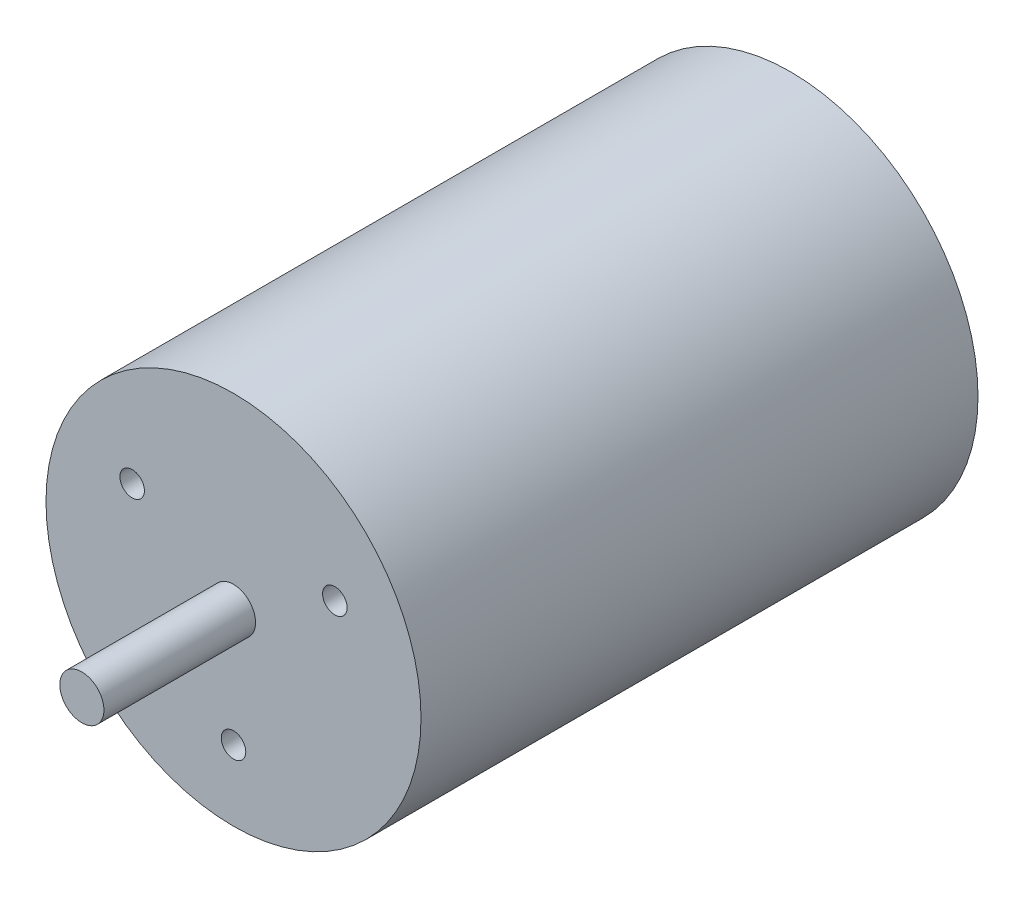
ISO-10303-21;
HEADER;
FILE_DESCRIPTION(('STEP AP214'),'2;1');
FILE_NAME('part.step','',(''),(''),'','','');
FILE_SCHEMA(('AUTOMOTIVE_DESIGN { 1 0 10303 214 1 1 1 1 }'));
ENDSEC;
DATA;
#1=APPLICATION_CONTEXT('core data for automotive mechanical design processes');
#2=APPLICATION_PROTOCOL_DEFINITION('international standard','automotive_design',2000,#1);
#3=PRODUCT_CONTEXT('',#1,'mechanical');
#4=PRODUCT('Part','Part','',(#3));
#5=PRODUCT_RELATED_PRODUCT_CATEGORY('part','',(#4));
#6=PRODUCT_DEFINITION_FORMATION('','',#4);
#7=PRODUCT_DEFINITION_CONTEXT('part definition',#1,'design');
#8=PRODUCT_DEFINITION('design','',#6,#7);
#9=PRODUCT_DEFINITION_SHAPE('','',#8);
#10=(LENGTH_UNIT() NAMED_UNIT(*) SI_UNIT(.MILLI.,.METRE.));
#11=(NAMED_UNIT(*) PLANE_ANGLE_UNIT() SI_UNIT($,.RADIAN.));
#12=(NAMED_UNIT(*) SI_UNIT($,.STERADIAN.) SOLID_ANGLE_UNIT());
#13=UNCERTAINTY_MEASURE_WITH_UNIT(LENGTH_MEASURE(1.E-05),#10,'distance_accuracy_value','');
#14=(GEOMETRIC_REPRESENTATION_CONTEXT(3) GLOBAL_UNCERTAINTY_ASSIGNED_CONTEXT((#13)) GLOBAL_UNIT_ASSIGNED_CONTEXT((#10,
#11,#12)) REPRESENTATION_CONTEXT('',''));
#15=CARTESIAN_POINT('',(0.,0.,0.));
#16=DIRECTION('',(0.,0.,1.));
#17=DIRECTION('',(1.,0.,0.));
#18=AXIS2_PLACEMENT_3D('',#15,#16,#17);
#19=CARTESIAN_POINT('',(0.,0.,101.));
#20=DIRECTION('',(0.,0.,-1.));
#21=DIRECTION('',(-1.,0.,0.));
#22=AXIS2_PLACEMENT_3D('',#19,#20,#21);
#23=CYLINDRICAL_SURFACE('',#22,34.);
#24=CARTESIAN_POINT('',(0.,0.,101.));
#25=DIRECTION('',(0.,0.,1.));
#26=DIRECTION('',(1.,0.,0.));
#27=AXIS2_PLACEMENT_3D('',#24,#25,#26);
#28=CIRCLE('',#27,34.);
#29=CARTESIAN_POINT('',(34.,0.,101.));
#30=VERTEX_POINT('',#29);
#31=EDGE_CURVE('E41',#30,#30,#28,.T.);
#32=ORIENTED_EDGE('',*,*,#31,.F.);
#33=EDGE_LOOP('',(#32));
#34=FACE_BOUND('',#33,.T.);
#35=CARTESIAN_POINT('',(0.,0.,0.));
#36=DIRECTION('',(0.,0.,1.));
#37=DIRECTION('',(1.,0.,0.));
#38=AXIS2_PLACEMENT_3D('',#35,#36,#37);
#39=CIRCLE('',#38,34.);
#40=CARTESIAN_POINT('',(34.,0.,0.));
#41=VERTEX_POINT('',#40);
#42=EDGE_CURVE('E37',#41,#41,#39,.T.);
#43=ORIENTED_EDGE('',*,*,#42,.T.);
#44=EDGE_LOOP('',(#43));
#45=FACE_BOUND('',#44,.T.);
#46=ADVANCED_FACE('F34',(#34,#45),#23,.T.);
#47=CARTESIAN_POINT('',(0.,0.,101.));
#48=DIRECTION('',(0.,0.,1.));
#49=DIRECTION('',(1.,0.,0.));
#50=AXIS2_PLACEMENT_3D('',#47,#48,#49);
#51=PLANE('',#50);
#52=CARTESIAN_POINT('',(-18.375,10.6088111963594,101.));
#53=DIRECTION('',(0.,0.,1.));
#54=DIRECTION('',(1.,0.,0.));
#55=AXIS2_PLACEMENT_3D('',#52,#53,#54);
#56=CIRCLE('',#55,2.225);
#57=CARTESIAN_POINT('',(-16.15,10.6088111963594,101.));
#58=VERTEX_POINT('',#57);
#59=EDGE_CURVE('E53',#58,#58,#56,.T.);
#60=ORIENTED_EDGE('',*,*,#59,.F.);
#61=EDGE_LOOP('',(#60));
#62=FACE_BOUND('',#61,.T.);
#63=CARTESIAN_POINT('',(18.375,10.6088111963594,101.));
#64=DIRECTION('',(0.,0.,1.));
#65=DIRECTION('',(1.,0.,0.));
#66=AXIS2_PLACEMENT_3D('',#63,#64,#65);
#67=CIRCLE('',#66,2.225);
#68=CARTESIAN_POINT('',(20.6,10.6088111963594,101.));
#69=VERTEX_POINT('',#68);
#70=EDGE_CURVE('E56',#69,#69,#67,.T.);
#71=ORIENTED_EDGE('',*,*,#70,.F.);
#72=EDGE_LOOP('',(#71));
#73=FACE_BOUND('',#72,.T.);
#74=CARTESIAN_POINT('',(0.,-21.2176223927188,101.));
#75=DIRECTION('',(0.,0.,1.));
#76=DIRECTION('',(1.,0.,0.));
#77=AXIS2_PLACEMENT_3D('',#74,#75,#76);
#78=CIRCLE('',#77,2.225);
#79=CARTESIAN_POINT('',(2.225,-21.2176223927188,101.));
#80=VERTEX_POINT('',#79);
#81=EDGE_CURVE('E62',#80,#80,#78,.T.);
#82=ORIENTED_EDGE('',*,*,#81,.F.);
#83=EDGE_LOOP('',(#82));
#84=FACE_BOUND('',#83,.T.);
#85=CARTESIAN_POINT('',(0.,0.,101.));
#86=DIRECTION('',(0.,0.,1.));
#87=DIRECTION('',(1.,0.,0.));
#88=AXIS2_PLACEMENT_3D('',#85,#86,#87);
#89=CIRCLE('',#88,4.);
#90=CARTESIAN_POINT('',(4.,0.,101.));
#91=VERTEX_POINT('',#90);
#92=EDGE_CURVE('E52',#91,#91,#89,.T.);
#93=ORIENTED_EDGE('',*,*,#92,.F.);
#94=EDGE_LOOP('',(#93));
#95=FACE_BOUND('',#94,.T.);
#96=ORIENTED_EDGE('',*,*,#31,.T.);
#97=EDGE_LOOP('',(#96));
#98=FACE_BOUND('',#97,.T.);
#99=ADVANCED_FACE('F76',(#62,#73,#84,#95,#98),#51,.T.);
#100=CARTESIAN_POINT('',(0.,0.,0.));
#101=DIRECTION('',(0.,0.,1.));
#102=DIRECTION('',(1.,0.,0.));
#103=AXIS2_PLACEMENT_3D('',#100,#101,#102);
#104=PLANE('',#103);
#105=CARTESIAN_POINT('',(0.,0.,0.));
#106=DIRECTION('',(0.,0.,-1.));
#107=DIRECTION('',(-1.,0.,0.));
#108=AXIS2_PLACEMENT_3D('',#105,#106,#107);
#109=CIRCLE('',#108,14.);
#110=CARTESIAN_POINT('',(-14.,0.,0.));
#111=VERTEX_POINT('',#110);
#112=EDGE_CURVE('E10',#111,#111,#109,.T.);
#113=ORIENTED_EDGE('',*,*,#112,.F.);
#114=EDGE_LOOP('',(#113));
#115=FACE_BOUND('',#114,.T.);
#116=ORIENTED_EDGE('',*,*,#42,.F.);
#117=EDGE_LOOP('',(#116));
#118=FACE_BOUND('',#117,.T.);
#119=ADVANCED_FACE('F79',(#115,#118),#104,.F.);
#120=CARTESIAN_POINT('',(0.,0.,128.5));
#121=DIRECTION('',(0.,0.,-1.));
#122=DIRECTION('',(-1.,0.,0.));
#123=AXIS2_PLACEMENT_3D('',#120,#121,#122);
#124=CYLINDRICAL_SURFACE('',#123,4.);
#125=CARTESIAN_POINT('',(0.,0.,128.5));
#126=DIRECTION('',(0.,0.,1.));
#127=DIRECTION('',(1.,0.,0.));
#128=AXIS2_PLACEMENT_3D('',#125,#126,#127);
#129=CIRCLE('',#128,4.);
#130=CARTESIAN_POINT('',(4.,0.,128.5));
#131=VERTEX_POINT('',#130);
#132=EDGE_CURVE('E68',#131,#131,#129,.T.);
#133=ORIENTED_EDGE('',*,*,#132,.F.);
#134=EDGE_LOOP('',(#133));
#135=FACE_BOUND('',#134,.T.);
#136=ORIENTED_EDGE('',*,*,#92,.T.);
#137=EDGE_LOOP('',(#136));
#138=FACE_BOUND('',#137,.T.);
#139=ADVANCED_FACE('F74',(#135,#138),#124,.T.);
#140=CARTESIAN_POINT('',(0.,0.,128.5));
#141=DIRECTION('',(0.,0.,1.));
#142=DIRECTION('',(1.,0.,0.));
#143=AXIS2_PLACEMENT_3D('',#140,#141,#142);
#144=PLANE('',#143);
#145=ORIENTED_EDGE('',*,*,#132,.T.);
#146=EDGE_LOOP('',(#145));
#147=FACE_BOUND('',#146,.T.);
#148=ADVANCED_FACE('F94',(#147),#144,.T.);
#149=CARTESIAN_POINT('',(0.,-21.2176223927188,81.));
#150=DIRECTION('',(0.,0.,1.));
#151=DIRECTION('',(1.,0.,0.));
#152=AXIS2_PLACEMENT_3D('',#149,#150,#151);
#153=CYLINDRICAL_SURFACE('',#152,2.225);
#154=CARTESIAN_POINT('',(0.,-21.2176223927188,81.));
#155=DIRECTION('',(0.,0.,1.));
#156=DIRECTION('',(1.,0.,0.));
#157=AXIS2_PLACEMENT_3D('',#154,#155,#156);
#158=CIRCLE('',#157,2.225);
#159=CARTESIAN_POINT('',(2.225,-21.2176223927188,81.));
#160=VERTEX_POINT('',#159);
#161=EDGE_CURVE('E65',#160,#160,#158,.T.);
#162=ORIENTED_EDGE('',*,*,#161,.F.);
#163=EDGE_LOOP('',(#162));
#164=FACE_BOUND('',#163,.T.);
#165=ORIENTED_EDGE('',*,*,#81,.T.);
#166=EDGE_LOOP('',(#165));
#167=FACE_BOUND('',#166,.T.);
#168=ADVANCED_FACE('F100',(#164,#167),#153,.F.);
#169=CARTESIAN_POINT('',(0.,-21.2176223927188,81.));
#170=DIRECTION('',(0.,0.,1.));
#171=DIRECTION('',(1.,0.,0.));
#172=AXIS2_PLACEMENT_3D('',#169,#170,#171);
#173=PLANE('',#172);
#174=ORIENTED_EDGE('',*,*,#161,.T.);
#175=EDGE_LOOP('',(#174));
#176=FACE_BOUND('',#175,.T.);
#177=ADVANCED_FACE('F102',(#176),#173,.T.);
#178=CARTESIAN_POINT('',(18.375,10.6088111963594,81.));
#179=DIRECTION('',(0.,0.,1.));
#180=DIRECTION('',(1.,0.,0.));
#181=AXIS2_PLACEMENT_3D('',#178,#179,#180);
#182=CYLINDRICAL_SURFACE('',#181,2.225);
#183=CARTESIAN_POINT('',(18.375,10.6088111963594,81.));
#184=DIRECTION('',(0.,0.,1.));
#185=DIRECTION('',(1.,0.,0.));
#186=AXIS2_PLACEMENT_3D('',#183,#184,#185);
#187=CIRCLE('',#186,2.225);
#188=CARTESIAN_POINT('',(20.6,10.6088111963594,81.));
#189=VERTEX_POINT('',#188);
#190=EDGE_CURVE('E59',#189,#189,#187,.T.);
#191=ORIENTED_EDGE('',*,*,#190,.F.);
#192=EDGE_LOOP('',(#191));
#193=FACE_BOUND('',#192,.T.);
#194=ORIENTED_EDGE('',*,*,#70,.T.);
#195=EDGE_LOOP('',(#194));
#196=FACE_BOUND('',#195,.T.);
#197=ADVANCED_FACE('F105',(#193,#196),#182,.F.);
#198=CARTESIAN_POINT('',(18.375,10.6088111963594,81.));
#199=DIRECTION('',(0.,0.,1.));
#200=DIRECTION('',(1.,0.,0.));
#201=AXIS2_PLACEMENT_3D('',#198,#199,#200);
#202=PLANE('',#201);
#203=ORIENTED_EDGE('',*,*,#190,.T.);
#204=EDGE_LOOP('',(#203));
#205=FACE_BOUND('',#204,.T.);
#206=ADVANCED_FACE('F110',(#205),#202,.T.);
#207=CARTESIAN_POINT('',(-18.375,10.6088111963594,81.));
#208=DIRECTION('',(0.,0.,1.));
#209=DIRECTION('',(1.,0.,0.));
#210=AXIS2_PLACEMENT_3D('',#207,#208,#209);
#211=CYLINDRICAL_SURFACE('',#210,2.225);
#212=CARTESIAN_POINT('',(-18.375,10.6088111963594,81.));
#213=DIRECTION('',(0.,0.,1.));
#214=DIRECTION('',(1.,0.,0.));
#215=AXIS2_PLACEMENT_3D('',#212,#213,#214);
#216=CIRCLE('',#215,2.225);
#217=CARTESIAN_POINT('',(-16.15,10.6088111963594,81.));
#218=VERTEX_POINT('',#217);
#219=EDGE_CURVE('E49',#218,#218,#216,.T.);
#220=ORIENTED_EDGE('',*,*,#219,.F.);
#221=EDGE_LOOP('',(#220));
#222=FACE_BOUND('',#221,.T.);
#223=ORIENTED_EDGE('',*,*,#59,.T.);
#224=EDGE_LOOP('',(#223));
#225=FACE_BOUND('',#224,.T.);
#226=ADVANCED_FACE('F113',(#222,#225),#211,.F.);
#227=CARTESIAN_POINT('',(-18.375,10.6088111963594,81.));
#228=DIRECTION('',(0.,0.,1.));
#229=DIRECTION('',(1.,0.,0.));
#230=AXIS2_PLACEMENT_3D('',#227,#228,#229);
#231=PLANE('',#230);
#232=ORIENTED_EDGE('',*,*,#219,.T.);
#233=EDGE_LOOP('',(#232));
#234=FACE_BOUND('',#233,.T.);
#235=ADVANCED_FACE('F120',(#234),#231,.T.);
#236=CARTESIAN_POINT('',(0.,0.,-7.));
#237=DIRECTION('',(0.,0.,1.));
#238=DIRECTION('',(1.,0.,0.));
#239=AXIS2_PLACEMENT_3D('',#236,#237,#238);
#240=CYLINDRICAL_SURFACE('',#239,14.);
#241=CARTESIAN_POINT('',(0.,0.,-7.));
#242=DIRECTION('',(0.,0.,-1.));
#243=DIRECTION('',(-1.,0.,0.));
#244=AXIS2_PLACEMENT_3D('',#241,#242,#243);
#245=CIRCLE('',#244,14.);
#246=CARTESIAN_POINT('',(-14.,0.,-7.));
#247=VERTEX_POINT('',#246);
#248=EDGE_CURVE('E48',#247,#247,#245,.T.);
#249=ORIENTED_EDGE('',*,*,#248,.F.);
#250=EDGE_LOOP('',(#249));
#251=FACE_BOUND('',#250,.T.);
#252=ORIENTED_EDGE('',*,*,#112,.T.);
#253=EDGE_LOOP('',(#252));
#254=FACE_BOUND('',#253,.T.);
#255=ADVANCED_FACE('F124',(#251,#254),#240,.T.);
#256=CARTESIAN_POINT('',(0.,0.,-7.));
#257=DIRECTION('',(0.,0.,-1.));
#258=DIRECTION('',(-1.,0.,0.));
#259=AXIS2_PLACEMENT_3D('',#256,#257,#258);
#260=PLANE('',#259);
#261=ORIENTED_EDGE('',*,*,#248,.T.);
#262=EDGE_LOOP('',(#261));
#263=FACE_BOUND('',#262,.T.);
#264=ADVANCED_FACE('F128',(#263),#260,.T.);
#265=CLOSED_SHELL('',(#46,#99,#119,#139,#148,#168,#177,#197,#206,#226,#235,#255,#264));
#266=MANIFOLD_SOLID_BREP('B2',#265);
#267=ADVANCED_BREP_SHAPE_REPRESENTATION('',(#18,#266),#14);
#268=SHAPE_DEFINITION_REPRESENTATION(#9,#267);
ENDSEC;
END-ISO-10303-21;
